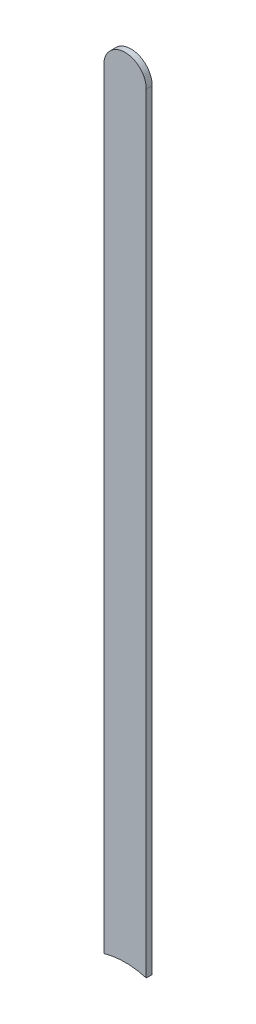
ISO-10303-21;
HEADER;
FILE_DESCRIPTION(('STEP AP214'),'2;1');
FILE_NAME('part.step','',(''),(''),'','','');
FILE_SCHEMA(('AUTOMOTIVE_DESIGN { 1 0 10303 214 1 1 1 1 }'));
ENDSEC;
DATA;
#1=APPLICATION_CONTEXT('core data for automotive mechanical design processes');
#2=APPLICATION_PROTOCOL_DEFINITION('international standard','automotive_design',2000,#1);
#3=PRODUCT_CONTEXT('',#1,'mechanical');
#4=PRODUCT('Part','Part','',(#3));
#5=PRODUCT_RELATED_PRODUCT_CATEGORY('part','',(#4));
#6=PRODUCT_DEFINITION_FORMATION('','',#4);
#7=PRODUCT_DEFINITION_CONTEXT('part definition',#1,'design');
#8=PRODUCT_DEFINITION('design','',#6,#7);
#9=PRODUCT_DEFINITION_SHAPE('','',#8);
#10=(LENGTH_UNIT() NAMED_UNIT(*) SI_UNIT(.MILLI.,.METRE.));
#11=(NAMED_UNIT(*) PLANE_ANGLE_UNIT() SI_UNIT($,.RADIAN.));
#12=(NAMED_UNIT(*) SI_UNIT($,.STERADIAN.) SOLID_ANGLE_UNIT());
#13=UNCERTAINTY_MEASURE_WITH_UNIT(LENGTH_MEASURE(1.E-05),#10,'distance_accuracy_value','');
#14=(GEOMETRIC_REPRESENTATION_CONTEXT(3) GLOBAL_UNCERTAINTY_ASSIGNED_CONTEXT((#13)) GLOBAL_UNIT_ASSIGNED_CONTEXT((#10,
#11,#12)) REPRESENTATION_CONTEXT('',''));
#15=CARTESIAN_POINT('',(0.,0.,0.));
#16=DIRECTION('',(0.,0.,1.));
#17=DIRECTION('',(1.,0.,0.));
#18=AXIS2_PLACEMENT_3D('',#15,#16,#17);
#19=CARTESIAN_POINT('',(89.0180084,93.0057145384794,0.));
#20=DIRECTION('',(-1.,0.,0.));
#21=DIRECTION('',(0.,1.,0.));
#22=AXIS2_PLACEMENT_3D('',#19,#20,#21);
#23=PLANE('',#22);
#24=DIRECTION('',(0.,1.,0.));
#25=VECTOR('',#24,1.);
#26=CARTESIAN_POINT('',(89.0180084,92.5740084,0.03556));
#27=LINE('',#26,#25);
#28=CARTESIAN_POINT('',(89.0180084,93.0057145384794,0.03556));
#29=VERTEX_POINT('',#28);
#30=CARTESIAN_POINT('',(89.0180084,97.6129366,0.03556));
#31=VERTEX_POINT('',#30);
#32=EDGE_CURVE('E11',#29,#31,#27,.T.);
#33=ORIENTED_EDGE('',*,*,#32,.F.);
#34=DIRECTION('',(0.,0.,1.));
#35=VECTOR('',#34,1.);
#36=CARTESIAN_POINT('',(89.0180084,93.0057145384794,0.));
#37=LINE('',#36,#35);
#38=CARTESIAN_POINT('',(89.0180084,93.0057145384794,0.));
#39=VERTEX_POINT('',#38);
#40=EDGE_CURVE('E24',#39,#29,#37,.T.);
#41=ORIENTED_EDGE('',*,*,#40,.F.);
#42=DIRECTION('',(0.,1.,0.));
#43=VECTOR('',#42,1.);
#44=CARTESIAN_POINT('',(89.0180084,92.5740084,0.));
#45=LINE('',#44,#43);
#46=CARTESIAN_POINT('',(89.0180084,97.6129366,0.));
#47=VERTEX_POINT('',#46);
#48=EDGE_CURVE('E75',#39,#47,#45,.T.);
#49=ORIENTED_EDGE('',*,*,#48,.T.);
#50=DIRECTION('',(0.,0.,1.));
#51=VECTOR('',#50,1.);
#52=CARTESIAN_POINT('',(89.0180084,97.6129366,0.));
#53=LINE('',#52,#51);
#54=EDGE_CURVE('E37',#47,#31,#53,.T.);
#55=ORIENTED_EDGE('',*,*,#54,.T.);
#56=EDGE_LOOP('',(#33,#41,#49,#55));
#57=FACE_BOUND('',#56,.T.);
#58=ADVANCED_FACE('F17',(#57),#23,.F.);
#59=CARTESIAN_POINT('',(88.8910084,97.6129366,0.));
#60=DIRECTION('',(0.,0.,-1.));
#61=DIRECTION('',(1.,0.,0.));
#62=AXIS2_PLACEMENT_3D('',#59,#60,#61);
#63=CYLINDRICAL_SURFACE('',#62,0.126999999999995);
#64=CARTESIAN_POINT('',(88.8910084,97.6129366,0.03556));
#65=DIRECTION('',(0.,0.,1.));
#66=DIRECTION('',(1.,0.,0.));
#67=AXIS2_PLACEMENT_3D('',#64,#65,#66);
#68=CIRCLE('',#67,0.126999999999995);
#69=CARTESIAN_POINT('',(88.7640084,97.6129366,0.03556));
#70=VERTEX_POINT('',#69);
#71=EDGE_CURVE('E83',#31,#70,#68,.T.);
#72=ORIENTED_EDGE('',*,*,#71,.F.);
#73=ORIENTED_EDGE('',*,*,#54,.F.);
#74=CARTESIAN_POINT('',(88.8910084,97.6129366,0.));
#75=DIRECTION('',(0.,0.,1.));
#76=DIRECTION('',(1.,0.,0.));
#77=AXIS2_PLACEMENT_3D('',#74,#75,#76);
#78=CIRCLE('',#77,0.126999999999995);
#79=CARTESIAN_POINT('',(88.7640084,97.6129366,0.));
#80=VERTEX_POINT('',#79);
#81=EDGE_CURVE('E81',#47,#80,#78,.T.);
#82=ORIENTED_EDGE('',*,*,#81,.T.);
#83=DIRECTION('',(0.,0.,1.));
#84=VECTOR('',#83,1.);
#85=CARTESIAN_POINT('',(88.7640084,97.6129366,0.));
#86=LINE('',#85,#84);
#87=EDGE_CURVE('E67',#80,#70,#86,.T.);
#88=ORIENTED_EDGE('',*,*,#87,.T.);
#89=EDGE_LOOP('',(#72,#73,#82,#88));
#90=FACE_BOUND('',#89,.T.);
#91=ADVANCED_FACE('F89',(#90),#63,.T.);
#92=CARTESIAN_POINT('',(88.7640084,97.6129366,0.));
#93=DIRECTION('',(1.,0.,0.));
#94=DIRECTION('',(0.,-1.,0.));
#95=AXIS2_PLACEMENT_3D('',#92,#93,#94);
#96=PLANE('',#95);
#97=DIRECTION('',(0.,-1.,0.));
#98=VECTOR('',#97,1.);
#99=CARTESIAN_POINT('',(88.7640084,97.6129366,0.03556));
#100=LINE('',#99,#98);
#101=CARTESIAN_POINT('',(88.7640084,93.0057145384794,0.03556));
#102=VERTEX_POINT('',#101);
#103=EDGE_CURVE('E71',#70,#102,#100,.T.);
#104=ORIENTED_EDGE('',*,*,#103,.F.);
#105=ORIENTED_EDGE('',*,*,#87,.F.);
#106=DIRECTION('',(0.,-1.,0.));
#107=VECTOR('',#106,1.);
#108=CARTESIAN_POINT('',(88.7640084,97.6129366,0.));
#109=LINE('',#108,#107);
#110=CARTESIAN_POINT('',(88.7640084,93.0057145384794,0.));
#111=VERTEX_POINT('',#110);
#112=EDGE_CURVE('E63',#80,#111,#109,.T.);
#113=ORIENTED_EDGE('',*,*,#112,.T.);
#114=DIRECTION('',(0.,0.,1.));
#115=VECTOR('',#114,1.);
#116=CARTESIAN_POINT('',(88.7640084,93.0057145384794,0.));
#117=LINE('',#116,#115);
#118=EDGE_CURVE('E53',#111,#102,#117,.T.);
#119=ORIENTED_EDGE('',*,*,#118,.T.);
#120=EDGE_LOOP('',(#104,#105,#113,#119));
#121=FACE_BOUND('',#120,.T.);
#122=ADVANCED_FACE('F66',(#121),#96,.F.);
#123=CARTESIAN_POINT('',(88.8910084,92.5740084,0.));
#124=DIRECTION('',(0.,0.,-1.));
#125=DIRECTION('',(1.,0.,0.));
#126=AXIS2_PLACEMENT_3D('',#123,#124,#125);
#127=CYLINDRICAL_SURFACE('',#126,0.4499991);
#128=ORIENTED_EDGE('',*,*,#40,.T.);
#129=CARTESIAN_POINT('',(88.8910084,92.5740084,0.03556));
#130=DIRECTION('',(0.,0.,1.));
#131=DIRECTION('',(1.,0.,0.));
#132=AXIS2_PLACEMENT_3D('',#129,#130,#131);
#133=CIRCLE('',#132,0.4499991);
#134=EDGE_CURVE('E59',#29,#102,#133,.T.);
#135=ORIENTED_EDGE('',*,*,#134,.T.);
#136=ORIENTED_EDGE('',*,*,#118,.F.);
#137=CARTESIAN_POINT('',(88.8910084,92.5740084,0.));
#138=DIRECTION('',(0.,0.,1.));
#139=DIRECTION('',(1.,0.,0.));
#140=AXIS2_PLACEMENT_3D('',#137,#138,#139);
#141=CIRCLE('',#140,0.4499991);
#142=EDGE_CURVE('E57',#39,#111,#141,.T.);
#143=ORIENTED_EDGE('',*,*,#142,.F.);
#144=EDGE_LOOP('',(#128,#135,#136,#143));
#145=FACE_BOUND('',#144,.T.);
#146=ADVANCED_FACE('F55',(#145),#127,.F.);
#147=CARTESIAN_POINT('',(89.0180084,92.5740084,0.));
#148=DIRECTION('',(0.,0.,-1.));
#149=DIRECTION('',(-1.,0.,0.));
#150=AXIS2_PLACEMENT_3D('',#147,#148,#149);
#151=PLANE('',#150);
#152=ORIENTED_EDGE('',*,*,#48,.F.);
#153=ORIENTED_EDGE('',*,*,#142,.T.);
#154=ORIENTED_EDGE('',*,*,#112,.F.);
#155=ORIENTED_EDGE('',*,*,#81,.F.);
#156=EDGE_LOOP('',(#152,#153,#154,#155));
#157=FACE_BOUND('',#156,.T.);
#158=ADVANCED_FACE('F74',(#157),#151,.T.);
#159=CARTESIAN_POINT('',(89.0180084,92.5740084,0.03556));
#160=DIRECTION('',(0.,0.,-1.));
#161=DIRECTION('',(-1.,0.,0.));
#162=AXIS2_PLACEMENT_3D('',#159,#160,#161);
#163=PLANE('',#162);
#164=ORIENTED_EDGE('',*,*,#134,.F.);
#165=ORIENTED_EDGE('',*,*,#32,.T.);
#166=ORIENTED_EDGE('',*,*,#71,.T.);
#167=ORIENTED_EDGE('',*,*,#103,.T.);
#168=EDGE_LOOP('',(#164,#165,#166,#167));
#169=FACE_BOUND('',#168,.T.);
#170=ADVANCED_FACE('F91',(#169),#163,.F.);
#171=CLOSED_SHELL('',(#58,#91,#122,#146,#158,#170));
#172=MANIFOLD_SOLID_BREP('B1',#171);
#173=ADVANCED_BREP_SHAPE_REPRESENTATION('',(#18,#172),#14);
#174=SHAPE_DEFINITION_REPRESENTATION(#9,#173);
ENDSEC;
END-ISO-10303-21;
